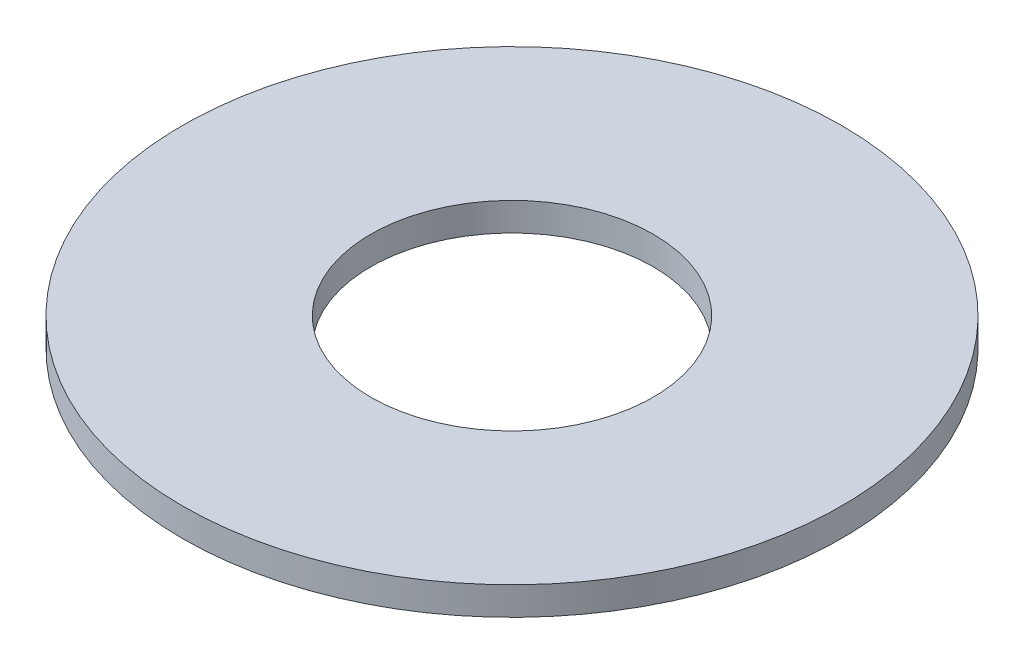
ISO-10303-21;
HEADER;
FILE_DESCRIPTION(('STEP AP214'),'2;1');
FILE_NAME('part.step','',(''),(''),'','','');
FILE_SCHEMA(('AUTOMOTIVE_DESIGN { 1 0 10303 214 1 1 1 1 }'));
ENDSEC;
DATA;
#1=APPLICATION_CONTEXT('core data for automotive mechanical design processes');
#2=APPLICATION_PROTOCOL_DEFINITION('international standard','automotive_design',2000,#1);
#3=PRODUCT_CONTEXT('',#1,'mechanical');
#4=PRODUCT('Part','Part','',(#3));
#5=PRODUCT_RELATED_PRODUCT_CATEGORY('part','',(#4));
#6=PRODUCT_DEFINITION_FORMATION('','',#4);
#7=PRODUCT_DEFINITION_CONTEXT('part definition',#1,'design');
#8=PRODUCT_DEFINITION('design','',#6,#7);
#9=PRODUCT_DEFINITION_SHAPE('','',#8);
#10=(LENGTH_UNIT() NAMED_UNIT(*) SI_UNIT(.MILLI.,.METRE.));
#11=(NAMED_UNIT(*) PLANE_ANGLE_UNIT() SI_UNIT($,.RADIAN.));
#12=(NAMED_UNIT(*) SI_UNIT($,.STERADIAN.) SOLID_ANGLE_UNIT());
#13=UNCERTAINTY_MEASURE_WITH_UNIT(LENGTH_MEASURE(1.E-05),#10,'distance_accuracy_value','');
#14=(GEOMETRIC_REPRESENTATION_CONTEXT(3) GLOBAL_UNCERTAINTY_ASSIGNED_CONTEXT((#13)) GLOBAL_UNIT_ASSIGNED_CONTEXT((#10,
#11,#12)) REPRESENTATION_CONTEXT('',''));
#15=CARTESIAN_POINT('',(0.,0.,0.));
#16=DIRECTION('',(0.,0.,1.));
#17=DIRECTION('',(1.,0.,0.));
#18=AXIS2_PLACEMENT_3D('',#15,#16,#17);
#19=CARTESIAN_POINT('',(0.,6.,0.));
#20=DIRECTION('',(0.,-1.,0.));
#21=DIRECTION('',(0.,0.,-1.));
#22=AXIS2_PLACEMENT_3D('',#19,#20,#21);
#23=CYLINDRICAL_SURFACE('',#22,70.);
#24=CARTESIAN_POINT('',(0.,6.,0.));
#25=DIRECTION('',(0.,1.,0.));
#26=DIRECTION('',(0.,0.,1.));
#27=AXIS2_PLACEMENT_3D('',#24,#25,#26);
#28=CIRCLE('',#27,70.);
#29=CARTESIAN_POINT('',(0.,6.,70.));
#30=VERTEX_POINT('',#29);
#31=EDGE_CURVE('E10',#30,#30,#28,.T.);
#32=ORIENTED_EDGE('',*,*,#31,.F.);
#33=EDGE_LOOP('',(#32));
#34=FACE_BOUND('',#33,.T.);
#35=CARTESIAN_POINT('',(0.,0.,0.));
#36=DIRECTION('',(0.,1.,0.));
#37=DIRECTION('',(0.,0.,1.));
#38=AXIS2_PLACEMENT_3D('',#35,#36,#37);
#39=CIRCLE('',#38,70.);
#40=CARTESIAN_POINT('',(0.,0.,70.));
#41=VERTEX_POINT('',#40);
#42=EDGE_CURVE('E37',#41,#41,#39,.T.);
#43=ORIENTED_EDGE('',*,*,#42,.T.);
#44=EDGE_LOOP('',(#43));
#45=FACE_BOUND('',#44,.T.);
#46=ADVANCED_FACE('F40',(#34,#45),#23,.T.);
#47=CARTESIAN_POINT('',(0.,6.,0.));
#48=DIRECTION('',(0.,1.,0.));
#49=DIRECTION('',(0.,0.,1.));
#50=AXIS2_PLACEMENT_3D('',#47,#48,#49);
#51=PLANE('',#50);
#52=CARTESIAN_POINT('',(0.,6.,0.));
#53=DIRECTION('',(0.,1.,0.));
#54=DIRECTION('',(0.,0.,1.));
#55=AXIS2_PLACEMENT_3D('',#52,#53,#54);
#56=CIRCLE('',#55,30.);
#57=CARTESIAN_POINT('',(0.,6.,30.));
#58=VERTEX_POINT('',#57);
#59=EDGE_CURVE('E50',#58,#58,#56,.T.);
#60=ORIENTED_EDGE('',*,*,#59,.F.);
#61=EDGE_LOOP('',(#60));
#62=FACE_BOUND('',#61,.T.);
#63=ORIENTED_EDGE('',*,*,#31,.T.);
#64=EDGE_LOOP('',(#63));
#65=FACE_BOUND('',#64,.T.);
#66=ADVANCED_FACE('F59',(#62,#65),#51,.T.);
#67=CARTESIAN_POINT('',(0.,0.,0.));
#68=DIRECTION('',(0.,1.,0.));
#69=DIRECTION('',(0.,0.,1.));
#70=AXIS2_PLACEMENT_3D('',#67,#68,#69);
#71=PLANE('',#70);
#72=CARTESIAN_POINT('',(0.,0.,0.));
#73=DIRECTION('',(0.,1.,0.));
#74=DIRECTION('',(0.,0.,1.));
#75=AXIS2_PLACEMENT_3D('',#72,#73,#74);
#76=CIRCLE('',#75,30.);
#77=CARTESIAN_POINT('',(0.,0.,30.));
#78=VERTEX_POINT('',#77);
#79=EDGE_CURVE('E47',#78,#78,#76,.T.);
#80=ORIENTED_EDGE('',*,*,#79,.T.);
#81=EDGE_LOOP('',(#80));
#82=FACE_BOUND('',#81,.T.);
#83=ORIENTED_EDGE('',*,*,#42,.F.);
#84=EDGE_LOOP('',(#83));
#85=FACE_BOUND('',#84,.T.);
#86=ADVANCED_FACE('F58',(#82,#85),#71,.F.);
#87=CARTESIAN_POINT('',(0.,6.,0.));
#88=DIRECTION('',(0.,-1.,0.));
#89=DIRECTION('',(0.,0.,-1.));
#90=AXIS2_PLACEMENT_3D('',#87,#88,#89);
#91=CYLINDRICAL_SURFACE('',#90,30.);
#92=ORIENTED_EDGE('',*,*,#59,.T.);
#93=EDGE_LOOP('',(#92));
#94=FACE_BOUND('',#93,.T.);
#95=ORIENTED_EDGE('',*,*,#79,.F.);
#96=EDGE_LOOP('',(#95));
#97=FACE_BOUND('',#96,.T.);
#98=ADVANCED_FACE('F54',(#94,#97),#91,.F.);
#99=CLOSED_SHELL('',(#46,#66,#86,#98));
#100=MANIFOLD_SOLID_BREP('B2',#99);
#101=ADVANCED_BREP_SHAPE_REPRESENTATION('',(#18,#100),#14);
#102=SHAPE_DEFINITION_REPRESENTATION(#9,#101);
ENDSEC;
END-ISO-10303-21;
